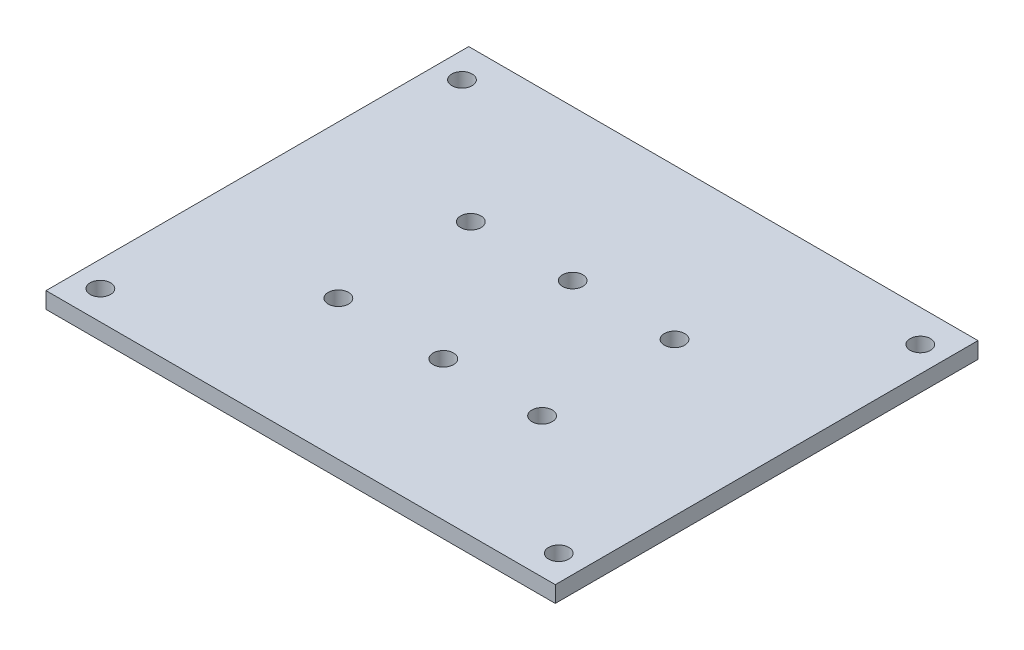
ISO-10303-21;
HEADER;
FILE_DESCRIPTION(('STEP AP214'),'2;1');
FILE_NAME('part.step','',(''),(''),'','','');
FILE_SCHEMA(('AUTOMOTIVE_DESIGN { 1 0 10303 214 1 1 1 1 }'));
ENDSEC;
DATA;
#1=APPLICATION_CONTEXT('core data for automotive mechanical design processes');
#2=APPLICATION_PROTOCOL_DEFINITION('international standard','automotive_design',2000,#1);
#3=PRODUCT_CONTEXT('',#1,'mechanical');
#4=PRODUCT('Part','Part','',(#3));
#5=PRODUCT_RELATED_PRODUCT_CATEGORY('part','',(#4));
#6=PRODUCT_DEFINITION_FORMATION('','',#4);
#7=PRODUCT_DEFINITION_CONTEXT('part definition',#1,'design');
#8=PRODUCT_DEFINITION('design','',#6,#7);
#9=PRODUCT_DEFINITION_SHAPE('','',#8);
#10=(LENGTH_UNIT() NAMED_UNIT(*) SI_UNIT(.MILLI.,.METRE.));
#11=(NAMED_UNIT(*) PLANE_ANGLE_UNIT() SI_UNIT($,.RADIAN.));
#12=(NAMED_UNIT(*) SI_UNIT($,.STERADIAN.) SOLID_ANGLE_UNIT());
#13=UNCERTAINTY_MEASURE_WITH_UNIT(LENGTH_MEASURE(1.E-05),#10,'distance_accuracy_value','');
#14=(GEOMETRIC_REPRESENTATION_CONTEXT(3) GLOBAL_UNCERTAINTY_ASSIGNED_CONTEXT((#13)) GLOBAL_UNIT_ASSIGNED_CONTEXT((#10,
#11,#12)) REPRESENTATION_CONTEXT('',''));
#15=CARTESIAN_POINT('',(0.,0.,0.));
#16=DIRECTION('',(0.,0.,1.));
#17=DIRECTION('',(1.,0.,0.));
#18=AXIS2_PLACEMENT_3D('',#15,#16,#17);
#19=CARTESIAN_POINT('',(0.,3.2,0.));
#20=DIRECTION('',(0.,1.,0.));
#21=DIRECTION('',(0.,0.,1.));
#22=AXIS2_PLACEMENT_3D('',#19,#20,#21);
#23=PLANE('',#22);
#24=CARTESIAN_POINT('',(40.,3.2,4.22567730405035));
#25=DIRECTION('',(0.,1.,0.));
#26=DIRECTION('',(0.,0.,1.));
#27=AXIS2_PLACEMENT_3D('',#24,#25,#26);
#28=CIRCLE('',#27,2.);
#29=CARTESIAN_POINT('',(40.,3.2,6.22567730405035));
#30=VERTEX_POINT('',#29);
#31=EDGE_CURVE('E190',#30,#30,#28,.T.);
#32=ORIENTED_EDGE('',*,*,#31,.F.);
#33=EDGE_LOOP('',(#32));
#34=FACE_BOUND('',#33,.T.);
#35=CARTESIAN_POINT('',(0.,3.2,30.2256773040503));
#36=DIRECTION('',(0.,1.,0.));
#37=DIRECTION('',(0.,0.,1.));
#38=AXIS2_PLACEMENT_3D('',#35,#36,#37);
#39=CIRCLE('',#38,2.);
#40=CARTESIAN_POINT('',(0.,3.2,32.2256773040504));
#41=VERTEX_POINT('',#40);
#42=EDGE_CURVE('E174',#41,#41,#39,.T.);
#43=ORIENTED_EDGE('',*,*,#42,.F.);
#44=EDGE_LOOP('',(#43));
#45=FACE_BOUND('',#44,.T.);
#46=CARTESIAN_POINT('',(20.,3.2,4.22567730405035));
#47=DIRECTION('',(0.,1.,0.));
#48=DIRECTION('',(0.,0.,1.));
#49=AXIS2_PLACEMENT_3D('',#46,#47,#48);
#50=CIRCLE('',#49,2.);
#51=CARTESIAN_POINT('',(20.,3.2,6.22567730405035));
#52=VERTEX_POINT('',#51);
#53=EDGE_CURVE('E158',#52,#52,#50,.T.);
#54=ORIENTED_EDGE('',*,*,#53,.F.);
#55=EDGE_LOOP('',(#54));
#56=FACE_BOUND('',#55,.T.);
#57=CARTESIAN_POINT('',(65.,3.2,51.959757952936));
#58=DIRECTION('',(0.,1.,0.));
#59=DIRECTION('',(0.,0.,1.));
#60=AXIS2_PLACEMENT_3D('',#57,#58,#59);
#61=CIRCLE('',#60,2.);
#62=CARTESIAN_POINT('',(65.,3.2,53.959757952936));
#63=VERTEX_POINT('',#62);
#64=EDGE_CURVE('E142',#63,#63,#61,.T.);
#65=ORIENTED_EDGE('',*,*,#64,.F.);
#66=EDGE_LOOP('',(#65));
#67=FACE_BOUND('',#66,.T.);
#68=CARTESIAN_POINT('',(-25.,3.2,-19.040242047064));
#69=DIRECTION('',(0.,1.,0.));
#70=DIRECTION('',(0.,0.,1.));
#71=AXIS2_PLACEMENT_3D('',#68,#69,#70);
#72=CIRCLE('',#71,2.);
#73=CARTESIAN_POINT('',(-25.,3.2,-17.040242047064));
#74=VERTEX_POINT('',#73);
#75=EDGE_CURVE('E112',#74,#74,#72,.T.);
#76=ORIENTED_EDGE('',*,*,#75,.F.);
#77=EDGE_LOOP('',(#76));
#78=FACE_BOUND('',#77,.T.);
#79=DIRECTION('',(0.,0.,1.));
#80=VECTOR('',#79,1.);
#81=CARTESIAN_POINT('',(-30.,3.2,-25.3652405454321));
#82=LINE('',#81,#80);
#83=CARTESIAN_POINT('',(-30.,3.2,-25.3652405454321));
#84=VERTEX_POINT('',#83);
#85=CARTESIAN_POINT('',(-30.,3.2,57.6347594545679));
#86=VERTEX_POINT('',#85);
#87=EDGE_CURVE('E92',#84,#86,#82,.T.);
#88=ORIENTED_EDGE('',*,*,#87,.T.);
#89=DIRECTION('',(1.,0.,0.));
#90=VECTOR('',#89,1.);
#91=CARTESIAN_POINT('',(-30.,3.2,57.6347594545679));
#92=LINE('',#91,#90);
#93=CARTESIAN_POINT('',(70.,3.2,57.6347594545679));
#94=VERTEX_POINT('',#93);
#95=EDGE_CURVE('E87',#86,#94,#92,.T.);
#96=ORIENTED_EDGE('',*,*,#95,.T.);
#97=DIRECTION('',(0.,0.,-1.));
#98=VECTOR('',#97,1.);
#99=CARTESIAN_POINT('',(70.,3.2,-25.3652405454321));
#100=LINE('',#99,#98);
#101=CARTESIAN_POINT('',(70.,3.2,-25.3652405454321));
#102=VERTEX_POINT('',#101);
#103=EDGE_CURVE('E90',#94,#102,#100,.T.);
#104=ORIENTED_EDGE('',*,*,#103,.T.);
#105=DIRECTION('',(-1.,0.,0.));
#106=VECTOR('',#105,1.);
#107=CARTESIAN_POINT('',(-30.,3.2,-25.3652405454321));
#108=LINE('',#107,#106);
#109=EDGE_CURVE('E57',#102,#84,#108,.T.);
#110=ORIENTED_EDGE('',*,*,#109,.T.);
#111=EDGE_LOOP('',(#88,#96,#104,#110));
#112=FACE_BOUND('',#111,.T.);
#113=CARTESIAN_POINT('',(-25.,3.2,51.959757952936));
#114=DIRECTION('',(0.,1.,0.));
#115=DIRECTION('',(0.,0.,1.));
#116=AXIS2_PLACEMENT_3D('',#113,#114,#115);
#117=CIRCLE('',#116,2.00000000000001);
#118=CARTESIAN_POINT('',(-25.,3.2,53.959757952936));
#119=VERTEX_POINT('',#118);
#120=EDGE_CURVE('E134',#119,#119,#117,.T.);
#121=ORIENTED_EDGE('',*,*,#120,.F.);
#122=EDGE_LOOP('',(#121));
#123=FACE_BOUND('',#122,.T.);
#124=CARTESIAN_POINT('',(65.,3.2,-19.040242047064));
#125=DIRECTION('',(0.,1.,0.));
#126=DIRECTION('',(0.,0.,1.));
#127=AXIS2_PLACEMENT_3D('',#124,#125,#126);
#128=CIRCLE('',#127,2.);
#129=CARTESIAN_POINT('',(65.,3.2,-17.040242047064));
#130=VERTEX_POINT('',#129);
#131=EDGE_CURVE('E150',#130,#130,#128,.T.);
#132=ORIENTED_EDGE('',*,*,#131,.F.);
#133=EDGE_LOOP('',(#132));
#134=FACE_BOUND('',#133,.T.);
#135=CARTESIAN_POINT('',(20.6058311783491,3.2,30.2256773040503));
#136=DIRECTION('',(0.,1.,0.));
#137=DIRECTION('',(0.,0.,1.));
#138=AXIS2_PLACEMENT_3D('',#135,#136,#137);
#139=CIRCLE('',#138,2.);
#140=CARTESIAN_POINT('',(20.6058311783491,3.2,32.2256773040504));
#141=VERTEX_POINT('',#140);
#142=EDGE_CURVE('E166',#141,#141,#139,.T.);
#143=ORIENTED_EDGE('',*,*,#142,.F.);
#144=EDGE_LOOP('',(#143));
#145=FACE_BOUND('',#144,.T.);
#146=CARTESIAN_POINT('',(0.,3.2,4.22567730405035));
#147=DIRECTION('',(0.,1.,0.));
#148=DIRECTION('',(0.,0.,1.));
#149=AXIS2_PLACEMENT_3D('',#146,#147,#148);
#150=CIRCLE('',#149,2.);
#151=CARTESIAN_POINT('',(0.,3.2,6.22567730405035));
#152=VERTEX_POINT('',#151);
#153=EDGE_CURVE('E182',#152,#152,#150,.T.);
#154=ORIENTED_EDGE('',*,*,#153,.F.);
#155=EDGE_LOOP('',(#154));
#156=FACE_BOUND('',#155,.T.);
#157=CARTESIAN_POINT('',(40.,3.2,30.2256773040503));
#158=DIRECTION('',(0.,1.,0.));
#159=DIRECTION('',(0.,0.,1.));
#160=AXIS2_PLACEMENT_3D('',#157,#158,#159);
#161=CIRCLE('',#160,2.);
#162=CARTESIAN_POINT('',(40.,3.2,32.2256773040504));
#163=VERTEX_POINT('',#162);
#164=EDGE_CURVE('E198',#163,#163,#161,.T.);
#165=ORIENTED_EDGE('',*,*,#164,.F.);
#166=EDGE_LOOP('',(#165));
#167=FACE_BOUND('',#166,.T.);
#168=ADVANCED_FACE('F39',(#34,#45,#56,#67,#78,#112,#123,#134,#145,#156,#167),#23,.T.);
#169=CARTESIAN_POINT('',(0.,0.,0.));
#170=DIRECTION('',(0.,1.,0.));
#171=DIRECTION('',(0.,0.,1.));
#172=AXIS2_PLACEMENT_3D('',#169,#170,#171);
#173=PLANE('',#172);
#174=DIRECTION('',(0.,0.,1.));
#175=VECTOR('',#174,1.);
#176=CARTESIAN_POINT('',(-30.,0.,-25.3652405454321));
#177=LINE('',#176,#175);
#178=CARTESIAN_POINT('',(-30.,0.,-25.3652405454321));
#179=VERTEX_POINT('',#178);
#180=CARTESIAN_POINT('',(-30.,0.,57.6347594545679));
#181=VERTEX_POINT('',#180);
#182=EDGE_CURVE('E108',#179,#181,#177,.T.);
#183=ORIENTED_EDGE('',*,*,#182,.F.);
#184=DIRECTION('',(-1.,0.,0.));
#185=VECTOR('',#184,1.);
#186=CARTESIAN_POINT('',(-30.,0.,-25.3652405454321));
#187=LINE('',#186,#185);
#188=CARTESIAN_POINT('',(70.,0.,-25.3652405454321));
#189=VERTEX_POINT('',#188);
#190=EDGE_CURVE('E80',#189,#179,#187,.T.);
#191=ORIENTED_EDGE('',*,*,#190,.F.);
#192=DIRECTION('',(0.,0.,-1.));
#193=VECTOR('',#192,1.);
#194=CARTESIAN_POINT('',(70.,0.,-25.3652405454321));
#195=LINE('',#194,#193);
#196=CARTESIAN_POINT('',(70.,0.,57.6347594545679));
#197=VERTEX_POINT('',#196);
#198=EDGE_CURVE('E74',#197,#189,#195,.T.);
#199=ORIENTED_EDGE('',*,*,#198,.F.);
#200=DIRECTION('',(1.,0.,0.));
#201=VECTOR('',#200,1.);
#202=CARTESIAN_POINT('',(-30.,0.,57.6347594545679));
#203=LINE('',#202,#201);
#204=EDGE_CURVE('E97',#181,#197,#203,.T.);
#205=ORIENTED_EDGE('',*,*,#204,.F.);
#206=EDGE_LOOP('',(#183,#191,#199,#205));
#207=FACE_BOUND('',#206,.T.);
#208=CARTESIAN_POINT('',(-25.,0.,-19.040242047064));
#209=DIRECTION('',(0.,1.,0.));
#210=DIRECTION('',(0.,0.,1.));
#211=AXIS2_PLACEMENT_3D('',#208,#209,#210);
#212=CIRCLE('',#211,2.);
#213=CARTESIAN_POINT('',(-25.,0.,-17.040242047064));
#214=VERTEX_POINT('',#213);
#215=EDGE_CURVE('E130',#214,#214,#212,.T.);
#216=ORIENTED_EDGE('',*,*,#215,.T.);
#217=EDGE_LOOP('',(#216));
#218=FACE_BOUND('',#217,.T.);
#219=CARTESIAN_POINT('',(-25.,0.,51.959757952936));
#220=DIRECTION('',(0.,1.,0.));
#221=DIRECTION('',(0.,0.,1.));
#222=AXIS2_PLACEMENT_3D('',#219,#220,#221);
#223=CIRCLE('',#222,2.00000000000001);
#224=CARTESIAN_POINT('',(-25.,0.,53.959757952936));
#225=VERTEX_POINT('',#224);
#226=EDGE_CURVE('E138',#225,#225,#223,.T.);
#227=ORIENTED_EDGE('',*,*,#226,.T.);
#228=EDGE_LOOP('',(#227));
#229=FACE_BOUND('',#228,.T.);
#230=CARTESIAN_POINT('',(65.,0.,51.959757952936));
#231=DIRECTION('',(0.,1.,0.));
#232=DIRECTION('',(0.,0.,1.));
#233=AXIS2_PLACEMENT_3D('',#230,#231,#232);
#234=CIRCLE('',#233,2.);
#235=CARTESIAN_POINT('',(65.,0.,53.959757952936));
#236=VERTEX_POINT('',#235);
#237=EDGE_CURVE('E146',#236,#236,#234,.T.);
#238=ORIENTED_EDGE('',*,*,#237,.T.);
#239=EDGE_LOOP('',(#238));
#240=FACE_BOUND('',#239,.T.);
#241=CARTESIAN_POINT('',(65.,0.,-19.040242047064));
#242=DIRECTION('',(0.,1.,0.));
#243=DIRECTION('',(0.,0.,1.));
#244=AXIS2_PLACEMENT_3D('',#241,#242,#243);
#245=CIRCLE('',#244,2.);
#246=CARTESIAN_POINT('',(65.,0.,-17.040242047064));
#247=VERTEX_POINT('',#246);
#248=EDGE_CURVE('E154',#247,#247,#245,.T.);
#249=ORIENTED_EDGE('',*,*,#248,.T.);
#250=EDGE_LOOP('',(#249));
#251=FACE_BOUND('',#250,.T.);
#252=CARTESIAN_POINT('',(20.,0.,4.22567730405035));
#253=DIRECTION('',(0.,1.,0.));
#254=DIRECTION('',(0.,0.,1.));
#255=AXIS2_PLACEMENT_3D('',#252,#253,#254);
#256=CIRCLE('',#255,2.);
#257=CARTESIAN_POINT('',(20.,0.,6.22567730405035));
#258=VERTEX_POINT('',#257);
#259=EDGE_CURVE('E162',#258,#258,#256,.T.);
#260=ORIENTED_EDGE('',*,*,#259,.T.);
#261=EDGE_LOOP('',(#260));
#262=FACE_BOUND('',#261,.T.);
#263=CARTESIAN_POINT('',(20.6058311783491,0.,30.2256773040503));
#264=DIRECTION('',(0.,1.,0.));
#265=DIRECTION('',(0.,0.,1.));
#266=AXIS2_PLACEMENT_3D('',#263,#264,#265);
#267=CIRCLE('',#266,2.);
#268=CARTESIAN_POINT('',(20.6058311783491,0.,32.2256773040504));
#269=VERTEX_POINT('',#268);
#270=EDGE_CURVE('E170',#269,#269,#267,.T.);
#271=ORIENTED_EDGE('',*,*,#270,.T.);
#272=EDGE_LOOP('',(#271));
#273=FACE_BOUND('',#272,.T.);
#274=CARTESIAN_POINT('',(0.,0.,30.2256773040503));
#275=DIRECTION('',(0.,1.,0.));
#276=DIRECTION('',(0.,0.,1.));
#277=AXIS2_PLACEMENT_3D('',#274,#275,#276);
#278=CIRCLE('',#277,2.);
#279=CARTESIAN_POINT('',(0.,0.,32.2256773040504));
#280=VERTEX_POINT('',#279);
#281=EDGE_CURVE('E178',#280,#280,#278,.T.);
#282=ORIENTED_EDGE('',*,*,#281,.T.);
#283=EDGE_LOOP('',(#282));
#284=FACE_BOUND('',#283,.T.);
#285=CARTESIAN_POINT('',(0.,0.,4.22567730405035));
#286=DIRECTION('',(0.,1.,0.));
#287=DIRECTION('',(0.,0.,1.));
#288=AXIS2_PLACEMENT_3D('',#285,#286,#287);
#289=CIRCLE('',#288,2.);
#290=CARTESIAN_POINT('',(0.,0.,6.22567730405035));
#291=VERTEX_POINT('',#290);
#292=EDGE_CURVE('E186',#291,#291,#289,.T.);
#293=ORIENTED_EDGE('',*,*,#292,.T.);
#294=EDGE_LOOP('',(#293));
#295=FACE_BOUND('',#294,.T.);
#296=CARTESIAN_POINT('',(40.,0.,4.22567730405035));
#297=DIRECTION('',(0.,1.,0.));
#298=DIRECTION('',(0.,0.,1.));
#299=AXIS2_PLACEMENT_3D('',#296,#297,#298);
#300=CIRCLE('',#299,2.);
#301=CARTESIAN_POINT('',(40.,0.,6.22567730405035));
#302=VERTEX_POINT('',#301);
#303=EDGE_CURVE('E194',#302,#302,#300,.T.);
#304=ORIENTED_EDGE('',*,*,#303,.T.);
#305=EDGE_LOOP('',(#304));
#306=FACE_BOUND('',#305,.T.);
#307=CARTESIAN_POINT('',(40.,0.,30.2256773040503));
#308=DIRECTION('',(0.,1.,0.));
#309=DIRECTION('',(0.,0.,1.));
#310=AXIS2_PLACEMENT_3D('',#307,#308,#309);
#311=CIRCLE('',#310,2.);
#312=CARTESIAN_POINT('',(40.,0.,32.2256773040504));
#313=VERTEX_POINT('',#312);
#314=EDGE_CURVE('E202',#313,#313,#311,.T.);
#315=ORIENTED_EDGE('',*,*,#314,.T.);
#316=EDGE_LOOP('',(#315));
#317=FACE_BOUND('',#316,.T.);
#318=ADVANCED_FACE('F125',(#207,#218,#229,#240,#251,#262,#273,#284,#295,#306,#317),#173,.F.);
#319=CARTESIAN_POINT('',(-30.,3.2,-25.3652405454321));
#320=DIRECTION('',(1.,0.,0.));
#321=DIRECTION('',(0.,0.,-1.));
#322=AXIS2_PLACEMENT_3D('',#319,#320,#321);
#323=PLANE('',#322);
#324=ORIENTED_EDGE('',*,*,#182,.T.);
#325=DIRECTION('',(0.,-1.,0.));
#326=VECTOR('',#325,1.);
#327=CARTESIAN_POINT('',(-30.,3.2,57.6347594545679));
#328=LINE('',#327,#326);
#329=EDGE_CURVE('E11',#86,#181,#328,.T.);
#330=ORIENTED_EDGE('',*,*,#329,.F.);
#331=ORIENTED_EDGE('',*,*,#87,.F.);
#332=DIRECTION('',(0.,-1.,0.));
#333=VECTOR('',#332,1.);
#334=CARTESIAN_POINT('',(-30.,3.2,-25.3652405454321));
#335=LINE('',#334,#333);
#336=EDGE_CURVE('E104',#84,#179,#335,.T.);
#337=ORIENTED_EDGE('',*,*,#336,.T.);
#338=EDGE_LOOP('',(#324,#330,#331,#337));
#339=FACE_BOUND('',#338,.T.);
#340=ADVANCED_FACE('F41',(#339),#323,.F.);
#341=CARTESIAN_POINT('',(-30.,3.2,57.6347594545679));
#342=DIRECTION('',(0.,0.,-1.));
#343=DIRECTION('',(-1.,0.,0.));
#344=AXIS2_PLACEMENT_3D('',#341,#342,#343);
#345=PLANE('',#344);
#346=ORIENTED_EDGE('',*,*,#204,.T.);
#347=DIRECTION('',(0.,-1.,0.));
#348=VECTOR('',#347,1.);
#349=CARTESIAN_POINT('',(70.,3.2,57.6347594545679));
#350=LINE('',#349,#348);
#351=EDGE_CURVE('E49',#94,#197,#350,.T.);
#352=ORIENTED_EDGE('',*,*,#351,.F.);
#353=ORIENTED_EDGE('',*,*,#95,.F.);
#354=ORIENTED_EDGE('',*,*,#329,.T.);
#355=EDGE_LOOP('',(#346,#352,#353,#354));
#356=FACE_BOUND('',#355,.T.);
#357=ADVANCED_FACE('F96',(#356),#345,.F.);
#358=CARTESIAN_POINT('',(70.,3.2,-25.3652405454321));
#359=DIRECTION('',(-1.,0.,0.));
#360=DIRECTION('',(0.,0.,1.));
#361=AXIS2_PLACEMENT_3D('',#358,#359,#360);
#362=PLANE('',#361);
#363=ORIENTED_EDGE('',*,*,#198,.T.);
#364=DIRECTION('',(0.,-1.,0.));
#365=VECTOR('',#364,1.);
#366=CARTESIAN_POINT('',(70.,3.2,-25.3652405454321));
#367=LINE('',#366,#365);
#368=EDGE_CURVE('E99',#102,#189,#367,.T.);
#369=ORIENTED_EDGE('',*,*,#368,.F.);
#370=ORIENTED_EDGE('',*,*,#103,.F.);
#371=ORIENTED_EDGE('',*,*,#351,.T.);
#372=EDGE_LOOP('',(#363,#369,#370,#371));
#373=FACE_BOUND('',#372,.T.);
#374=ADVANCED_FACE('F100',(#373),#362,.F.);
#375=CARTESIAN_POINT('',(-30.,3.2,-25.3652405454321));
#376=DIRECTION('',(0.,0.,1.));
#377=DIRECTION('',(1.,0.,0.));
#378=AXIS2_PLACEMENT_3D('',#375,#376,#377);
#379=PLANE('',#378);
#380=ORIENTED_EDGE('',*,*,#190,.T.);
#381=ORIENTED_EDGE('',*,*,#336,.F.);
#382=ORIENTED_EDGE('',*,*,#109,.F.);
#383=ORIENTED_EDGE('',*,*,#368,.T.);
#384=EDGE_LOOP('',(#380,#381,#382,#383));
#385=FACE_BOUND('',#384,.T.);
#386=ADVANCED_FACE('F122',(#385),#379,.F.);
#387=CARTESIAN_POINT('',(-25.,3.2,-19.040242047064));
#388=DIRECTION('',(0.,-1.,0.));
#389=DIRECTION('',(0.,0.,-1.));
#390=AXIS2_PLACEMENT_3D('',#387,#388,#389);
#391=CYLINDRICAL_SURFACE('',#390,2.);
#392=ORIENTED_EDGE('',*,*,#75,.T.);
#393=EDGE_LOOP('',(#392));
#394=FACE_BOUND('',#393,.T.);
#395=ORIENTED_EDGE('',*,*,#215,.F.);
#396=EDGE_LOOP('',(#395));
#397=FACE_BOUND('',#396,.T.);
#398=ADVANCED_FACE('F223',(#394,#397),#391,.F.);
#399=CARTESIAN_POINT('',(-25.,3.2,51.959757952936));
#400=DIRECTION('',(0.,-1.,0.));
#401=DIRECTION('',(0.,0.,-1.));
#402=AXIS2_PLACEMENT_3D('',#399,#400,#401);
#403=CYLINDRICAL_SURFACE('',#402,2.00000000000001);
#404=ORIENTED_EDGE('',*,*,#120,.T.);
#405=EDGE_LOOP('',(#404));
#406=FACE_BOUND('',#405,.T.);
#407=ORIENTED_EDGE('',*,*,#226,.F.);
#408=EDGE_LOOP('',(#407));
#409=FACE_BOUND('',#408,.T.);
#410=ADVANCED_FACE('F269',(#406,#409),#403,.F.);
#411=CARTESIAN_POINT('',(65.,3.2,51.959757952936));
#412=DIRECTION('',(0.,-1.,0.));
#413=DIRECTION('',(0.,0.,-1.));
#414=AXIS2_PLACEMENT_3D('',#411,#412,#413);
#415=CYLINDRICAL_SURFACE('',#414,2.);
#416=ORIENTED_EDGE('',*,*,#64,.T.);
#417=EDGE_LOOP('',(#416));
#418=FACE_BOUND('',#417,.T.);
#419=ORIENTED_EDGE('',*,*,#237,.F.);
#420=EDGE_LOOP('',(#419));
#421=FACE_BOUND('',#420,.T.);
#422=ADVANCED_FACE('F277',(#418,#421),#415,.F.);
#423=CARTESIAN_POINT('',(65.,3.2,-19.040242047064));
#424=DIRECTION('',(0.,-1.,0.));
#425=DIRECTION('',(0.,0.,-1.));
#426=AXIS2_PLACEMENT_3D('',#423,#424,#425);
#427=CYLINDRICAL_SURFACE('',#426,2.);
#428=ORIENTED_EDGE('',*,*,#131,.T.);
#429=EDGE_LOOP('',(#428));
#430=FACE_BOUND('',#429,.T.);
#431=ORIENTED_EDGE('',*,*,#248,.F.);
#432=EDGE_LOOP('',(#431));
#433=FACE_BOUND('',#432,.T.);
#434=ADVANCED_FACE('F285',(#430,#433),#427,.F.);
#435=CARTESIAN_POINT('',(20.,3.2,4.22567730405035));
#436=DIRECTION('',(0.,-1.,0.));
#437=DIRECTION('',(0.,0.,-1.));
#438=AXIS2_PLACEMENT_3D('',#435,#436,#437);
#439=CYLINDRICAL_SURFACE('',#438,2.);
#440=ORIENTED_EDGE('',*,*,#53,.T.);
#441=EDGE_LOOP('',(#440));
#442=FACE_BOUND('',#441,.T.);
#443=ORIENTED_EDGE('',*,*,#259,.F.);
#444=EDGE_LOOP('',(#443));
#445=FACE_BOUND('',#444,.T.);
#446=ADVANCED_FACE('F294',(#442,#445),#439,.F.);
#447=CARTESIAN_POINT('',(20.6058311783491,3.2,30.2256773040503));
#448=DIRECTION('',(0.,-1.,0.));
#449=DIRECTION('',(0.,0.,-1.));
#450=AXIS2_PLACEMENT_3D('',#447,#448,#449);
#451=CYLINDRICAL_SURFACE('',#450,2.);
#452=ORIENTED_EDGE('',*,*,#142,.T.);
#453=EDGE_LOOP('',(#452));
#454=FACE_BOUND('',#453,.T.);
#455=ORIENTED_EDGE('',*,*,#270,.F.);
#456=EDGE_LOOP('',(#455));
#457=FACE_BOUND('',#456,.T.);
#458=ADVANCED_FACE('F303',(#454,#457),#451,.F.);
#459=CARTESIAN_POINT('',(0.,3.2,30.2256773040503));
#460=DIRECTION('',(0.,-1.,0.));
#461=DIRECTION('',(0.,0.,-1.));
#462=AXIS2_PLACEMENT_3D('',#459,#460,#461);
#463=CYLINDRICAL_SURFACE('',#462,2.);
#464=ORIENTED_EDGE('',*,*,#42,.T.);
#465=EDGE_LOOP('',(#464));
#466=FACE_BOUND('',#465,.T.);
#467=ORIENTED_EDGE('',*,*,#281,.F.);
#468=EDGE_LOOP('',(#467));
#469=FACE_BOUND('',#468,.T.);
#470=ADVANCED_FACE('F312',(#466,#469),#463,.F.);
#471=CARTESIAN_POINT('',(0.,3.2,4.22567730405035));
#472=DIRECTION('',(0.,-1.,0.));
#473=DIRECTION('',(0.,0.,-1.));
#474=AXIS2_PLACEMENT_3D('',#471,#472,#473);
#475=CYLINDRICAL_SURFACE('',#474,2.);
#476=ORIENTED_EDGE('',*,*,#153,.T.);
#477=EDGE_LOOP('',(#476));
#478=FACE_BOUND('',#477,.T.);
#479=ORIENTED_EDGE('',*,*,#292,.F.);
#480=EDGE_LOOP('',(#479));
#481=FACE_BOUND('',#480,.T.);
#482=ADVANCED_FACE('F321',(#478,#481),#475,.F.);
#483=CARTESIAN_POINT('',(40.,3.2,4.22567730405035));
#484=DIRECTION('',(0.,-1.,0.));
#485=DIRECTION('',(0.,0.,-1.));
#486=AXIS2_PLACEMENT_3D('',#483,#484,#485);
#487=CYLINDRICAL_SURFACE('',#486,2.);
#488=ORIENTED_EDGE('',*,*,#31,.T.);
#489=EDGE_LOOP('',(#488));
#490=FACE_BOUND('',#489,.T.);
#491=ORIENTED_EDGE('',*,*,#303,.F.);
#492=EDGE_LOOP('',(#491));
#493=FACE_BOUND('',#492,.T.);
#494=ADVANCED_FACE('F330',(#490,#493),#487,.F.);
#495=CARTESIAN_POINT('',(40.,3.2,30.2256773040503));
#496=DIRECTION('',(0.,-1.,0.));
#497=DIRECTION('',(0.,0.,-1.));
#498=AXIS2_PLACEMENT_3D('',#495,#496,#497);
#499=CYLINDRICAL_SURFACE('',#498,2.);
#500=ORIENTED_EDGE('',*,*,#164,.T.);
#501=EDGE_LOOP('',(#500));
#502=FACE_BOUND('',#501,.T.);
#503=ORIENTED_EDGE('',*,*,#314,.F.);
#504=EDGE_LOOP('',(#503));
#505=FACE_BOUND('',#504,.T.);
#506=ADVANCED_FACE('F210',(#502,#505),#499,.F.);
#507=CLOSED_SHELL('',(#168,#318,#340,#357,#374,#386,#398,#410,#422,#434,#446,#458,#470,#482,
#494,#506));
#508=MANIFOLD_SOLID_BREP('B2',#507);
#509=ADVANCED_BREP_SHAPE_REPRESENTATION('',(#18,#508),#14);
#510=SHAPE_DEFINITION_REPRESENTATION(#9,#509);
ENDSEC;
END-ISO-10303-21;
